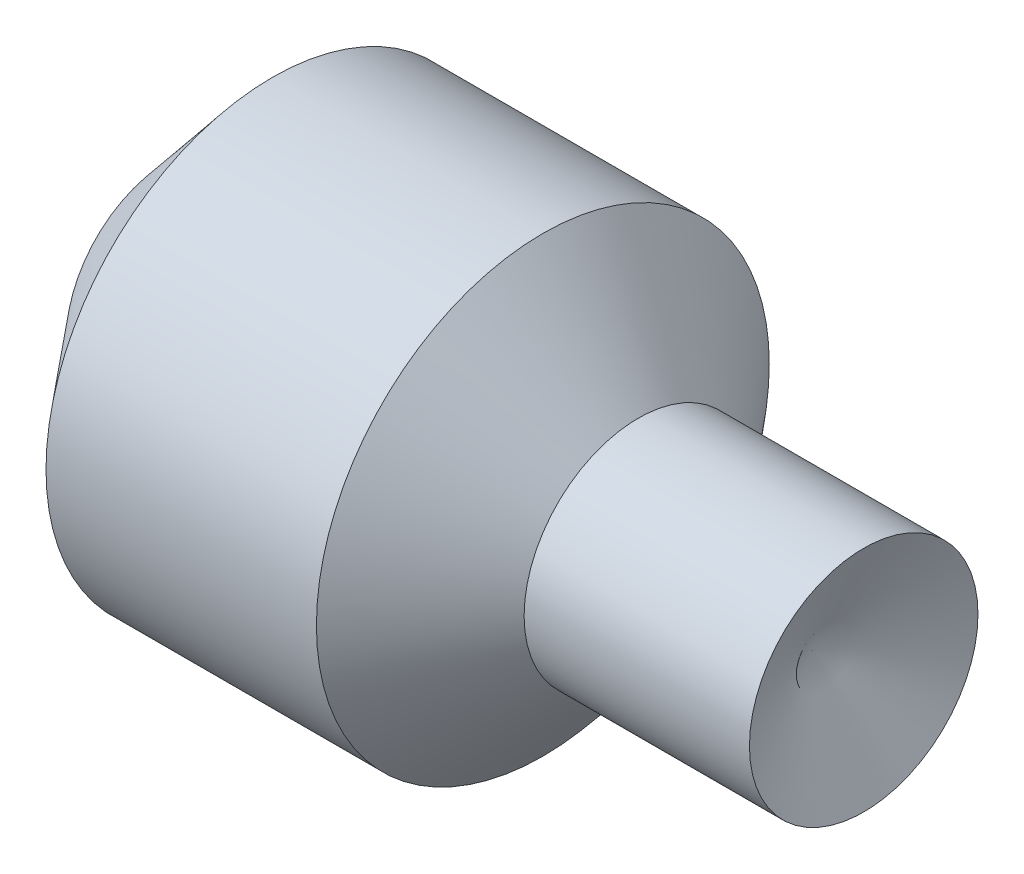
ISO-10303-21;
HEADER;
FILE_DESCRIPTION(('STEP AP214'),'2;1');
FILE_NAME('part.step','',(''),(''),'','','');
FILE_SCHEMA(('AUTOMOTIVE_DESIGN { 1 0 10303 214 1 1 1 1 }'));
ENDSEC;
DATA;
#1=APPLICATION_CONTEXT('core data for automotive mechanical design processes');
#2=APPLICATION_PROTOCOL_DEFINITION('international standard','automotive_design',2000,#1);
#3=PRODUCT_CONTEXT('',#1,'mechanical');
#4=PRODUCT('Part','Part','',(#3));
#5=PRODUCT_RELATED_PRODUCT_CATEGORY('part','',(#4));
#6=PRODUCT_DEFINITION_FORMATION('','',#4);
#7=PRODUCT_DEFINITION_CONTEXT('part definition',#1,'design');
#8=PRODUCT_DEFINITION('design','',#6,#7);
#9=PRODUCT_DEFINITION_SHAPE('','',#8);
#10=(LENGTH_UNIT() NAMED_UNIT(*) SI_UNIT(.MILLI.,.METRE.));
#11=(NAMED_UNIT(*) PLANE_ANGLE_UNIT() SI_UNIT($,.RADIAN.));
#12=(NAMED_UNIT(*) SI_UNIT($,.STERADIAN.) SOLID_ANGLE_UNIT());
#13=UNCERTAINTY_MEASURE_WITH_UNIT(LENGTH_MEASURE(1.E-05),#10,'distance_accuracy_value','');
#14=(GEOMETRIC_REPRESENTATION_CONTEXT(3) GLOBAL_UNCERTAINTY_ASSIGNED_CONTEXT((#13)) GLOBAL_UNIT_ASSIGNED_CONTEXT((#10,
#11,#12)) REPRESENTATION_CONTEXT('',''));
#15=CARTESIAN_POINT('',(0.,0.,0.));
#16=DIRECTION('',(0.,0.,1.));
#17=DIRECTION('',(1.,0.,0.));
#18=AXIS2_PLACEMENT_3D('',#15,#16,#17);
#19=CARTESIAN_POINT('',(-4.773363077621,14.8131881676253,0.));
#20=DIRECTION('',(1.,0.,0.));
#21=DIRECTION('',(0.,0.,-1.));
#22=AXIS2_PLACEMENT_3D('',#19,#20,#21);
#23=CONICAL_SURFACE('',#22,0.,1.14563412100907);
#24=CARTESIAN_POINT('',(6.63271390178416,14.8131881676253,0.));
#25=DIRECTION('',(-1.,0.,0.));
#26=DIRECTION('',(0.,0.,1.));
#27=AXIS2_PLACEMENT_3D('',#24,#25,#26);
#28=CIRCLE('',#27,25.1912900575185);
#29=CARTESIAN_POINT('',(6.63271390178416,14.8131881676253,25.1912900575185));
#30=VERTEX_POINT('',#29);
#31=EDGE_CURVE('E11',#30,#30,#28,.T.);
#32=ORIENTED_EDGE('',*,*,#31,.F.);
#33=EDGE_LOOP('',(#32));
#34=FACE_BOUND('',#33,.T.);
#35=CARTESIAN_POINT('',(-4.773363077621,14.8131881676253,0.));
#36=VERTEX_POINT('',#35);
#37=VERTEX_LOOP('',#36);
#38=FACE_BOUND('',#37,.T.);
#39=ADVANCED_FACE('F35',(#34,#38),#23,.F.);
#40=CARTESIAN_POINT('',(-145.224640247764,14.8131881676253,0.));
#41=DIRECTION('',(-1.,0.,0.));
#42=DIRECTION('',(0.,0.,1.));
#43=AXIS2_PLACEMENT_3D('',#40,#41,#42);
#44=CYLINDRICAL_SURFACE('',#43,25.1912900575185);
#45=CARTESIAN_POINT('',(-43.0402524088157,14.8131881676253,0.));
#46=DIRECTION('',(-1.,0.,0.));
#47=DIRECTION('',(0.,0.,1.));
#48=AXIS2_PLACEMENT_3D('',#45,#46,#47);
#49=CIRCLE('',#48,25.1912900575185);
#50=CARTESIAN_POINT('',(-43.0402524088157,14.8131881676253,25.1912900575185));
#51=VERTEX_POINT('',#50);
#52=EDGE_CURVE('E42',#51,#51,#49,.T.);
#53=ORIENTED_EDGE('',*,*,#52,.F.);
#54=EDGE_LOOP('',(#53));
#55=FACE_BOUND('',#54,.T.);
#56=ORIENTED_EDGE('',*,*,#31,.T.);
#57=EDGE_LOOP('',(#56));
#58=FACE_BOUND('',#57,.T.);
#59=ADVANCED_FACE('F69',(#55,#58),#44,.T.);
#60=CARTESIAN_POINT('',(-43.0402524088157,14.8131881676253,0.));
#61=DIRECTION('',(-1.,0.,0.));
#62=DIRECTION('',(0.,0.,1.));
#63=AXIS2_PLACEMENT_3D('',#60,#61,#62);
#64=CONICAL_SURFACE('',#63,25.1912900575185,0.86515449431598);
#65=CARTESIAN_POINT('',(-64.1026276522101,14.8131881676253,0.));
#66=DIRECTION('',(-1.,0.,0.));
#67=DIRECTION('',(0.,0.,1.));
#68=AXIS2_PLACEMENT_3D('',#65,#66,#67);
#69=CIRCLE('',#68,49.9129981917042);
#70=CARTESIAN_POINT('',(-64.1026276522101,14.8131881676253,49.9129981917042));
#71=VERTEX_POINT('',#70);
#72=EDGE_CURVE('E60',#71,#71,#69,.T.);
#73=ORIENTED_EDGE('',*,*,#72,.F.);
#74=EDGE_LOOP('',(#73));
#75=FACE_BOUND('',#74,.T.);
#76=ORIENTED_EDGE('',*,*,#52,.T.);
#77=EDGE_LOOP('',(#76));
#78=FACE_BOUND('',#77,.T.);
#79=ADVANCED_FACE('F67',(#75,#78),#64,.T.);
#80=CARTESIAN_POINT('',(-145.224640247764,14.8131881676253,0.));
#81=DIRECTION('',(-1.,0.,0.));
#82=DIRECTION('',(0.,0.,1.));
#83=AXIS2_PLACEMENT_3D('',#80,#81,#82);
#84=CYLINDRICAL_SURFACE('',#83,49.9129981917042);
#85=CARTESIAN_POINT('',(-123.71018722493,14.8131881676253,0.));
#86=DIRECTION('',(-1.,0.,0.));
#87=DIRECTION('',(0.,0.,1.));
#88=AXIS2_PLACEMENT_3D('',#85,#86,#87);
#89=CIRCLE('',#88,49.9129981917042);
#90=CARTESIAN_POINT('',(-123.71018722493,14.8131881676253,49.9129981917042));
#91=VERTEX_POINT('',#90);
#92=EDGE_CURVE('E57',#91,#91,#89,.T.);
#93=ORIENTED_EDGE('',*,*,#92,.F.);
#94=EDGE_LOOP('',(#93));
#95=FACE_BOUND('',#94,.T.);
#96=ORIENTED_EDGE('',*,*,#72,.T.);
#97=EDGE_LOOP('',(#96));
#98=FACE_BOUND('',#97,.T.);
#99=ADVANCED_FACE('F87',(#95,#98),#84,.T.);
#100=CARTESIAN_POINT('',(-123.71018722493,14.8131881676253,0.));
#101=DIRECTION('',(1.,0.,0.));
#102=DIRECTION('',(0.,0.,-1.));
#103=AXIS2_PLACEMENT_3D('',#100,#101,#102);
#104=CONICAL_SURFACE('',#103,49.9129981917042,0.87476522649623);
#105=CARTESIAN_POINT('',(-146.240425515809,14.8131881676253,0.));
#106=DIRECTION('',(-1.,0.,0.));
#107=DIRECTION('',(0.,0.,1.));
#108=AXIS2_PLACEMENT_3D('',#105,#106,#107);
#109=CIRCLE('',#108,22.9476736230929);
#110=CARTESIAN_POINT('',(-146.240425515809,14.8131881676253,22.9476736230929));
#111=VERTEX_POINT('',#110);
#112=EDGE_CURVE('E55',#111,#111,#109,.T.);
#113=ORIENTED_EDGE('',*,*,#112,.F.);
#114=EDGE_LOOP('',(#113));
#115=FACE_BOUND('',#114,.T.);
#116=ORIENTED_EDGE('',*,*,#92,.T.);
#117=EDGE_LOOP('',(#116));
#118=FACE_BOUND('',#117,.T.);
#119=ADVANCED_FACE('F51',(#115,#118),#104,.T.);
#120=CARTESIAN_POINT('',(-146.240425515809,14.8131881676253,0.));
#121=DIRECTION('',(1.,0.,0.));
#122=DIRECTION('',(0.,0.,-1.));
#123=AXIS2_PLACEMENT_3D('',#120,#121,#122);
#124=CONICAL_SURFACE('',#123,22.9476736230929,1.14566231893299);
#125=CARTESIAN_POINT('',(-156.629861269882,14.8131881676253,0.));
#126=VERTEX_POINT('',#125);
#127=VERTEX_LOOP('',#126);
#128=FACE_BOUND('',#127,.T.);
#129=ORIENTED_EDGE('',*,*,#112,.T.);
#130=EDGE_LOOP('',(#129));
#131=FACE_BOUND('',#130,.T.);
#132=ADVANCED_FACE('F48',(#128,#131),#124,.T.);
#133=CLOSED_SHELL('',(#39,#59,#79,#99,#119,#132));
#134=MANIFOLD_SOLID_BREP('B2',#133);
#135=ADVANCED_BREP_SHAPE_REPRESENTATION('',(#18,#134),#14);
#136=SHAPE_DEFINITION_REPRESENTATION(#9,#135);
ENDSEC;
END-ISO-10303-21;
